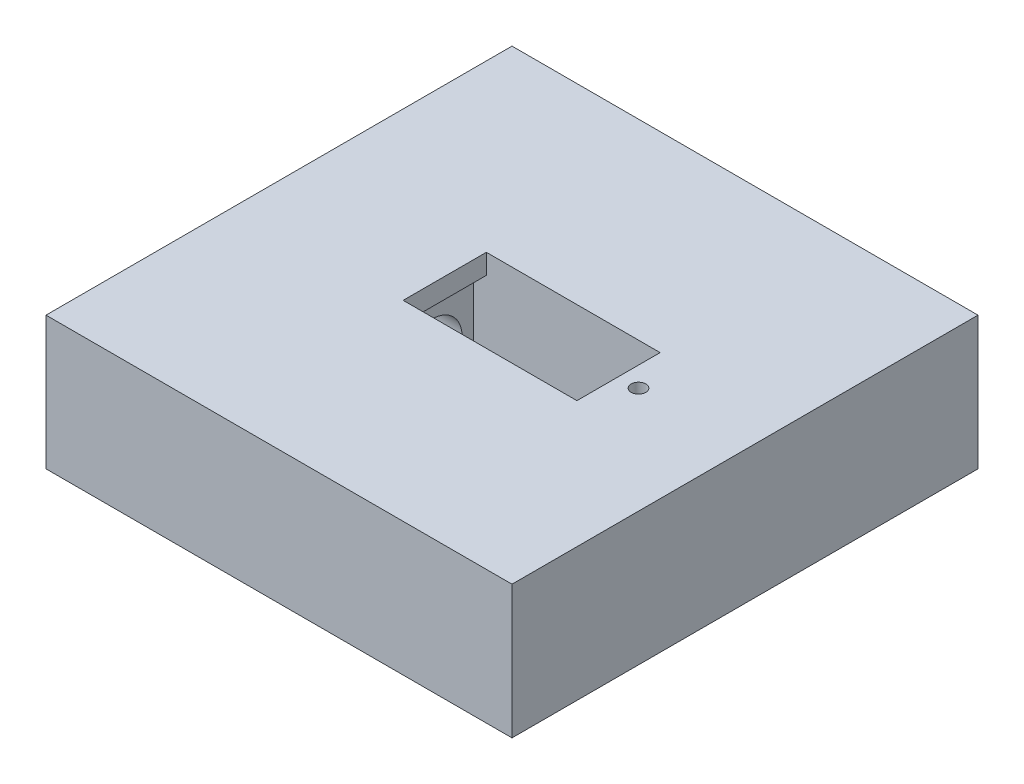
ISO-10303-21;
HEADER;
FILE_DESCRIPTION(('STEP AP214'),'2;1');
FILE_NAME('part.step','',(''),(''),'','','');
FILE_SCHEMA(('AUTOMOTIVE_DESIGN { 1 0 10303 214 1 1 1 1 }'));
ENDSEC;
DATA;
#1=APPLICATION_CONTEXT('core data for automotive mechanical design processes');
#2=APPLICATION_PROTOCOL_DEFINITION('international standard','automotive_design',2000,#1);
#3=PRODUCT_CONTEXT('',#1,'mechanical');
#4=PRODUCT('Part','Part','',(#3));
#5=PRODUCT_RELATED_PRODUCT_CATEGORY('part','',(#4));
#6=PRODUCT_DEFINITION_FORMATION('','',#4);
#7=PRODUCT_DEFINITION_CONTEXT('part definition',#1,'design');
#8=PRODUCT_DEFINITION('design','',#6,#7);
#9=PRODUCT_DEFINITION_SHAPE('','',#8);
#10=(LENGTH_UNIT() NAMED_UNIT(*) SI_UNIT(.MILLI.,.METRE.));
#11=(NAMED_UNIT(*) PLANE_ANGLE_UNIT() SI_UNIT($,.RADIAN.));
#12=(NAMED_UNIT(*) SI_UNIT($,.STERADIAN.) SOLID_ANGLE_UNIT());
#13=UNCERTAINTY_MEASURE_WITH_UNIT(LENGTH_MEASURE(1.E-05),#10,'distance_accuracy_value','');
#14=(GEOMETRIC_REPRESENTATION_CONTEXT(3) GLOBAL_UNCERTAINTY_ASSIGNED_CONTEXT((#13)) GLOBAL_UNIT_ASSIGNED_CONTEXT((#10,
#11,#12)) REPRESENTATION_CONTEXT('',''));
#15=CARTESIAN_POINT('',(0.,0.,0.));
#16=DIRECTION('',(0.,0.,1.));
#17=DIRECTION('',(1.,0.,0.));
#18=AXIS2_PLACEMENT_3D('',#15,#16,#17);
#19=CARTESIAN_POINT('',(-35.001,46.,22.1));
#20=DIRECTION('',(1.,0.,0.));
#21=DIRECTION('',(0.,0.,-1.));
#22=AXIS2_PLACEMENT_3D('',#19,#20,#21);
#23=CYLINDRICAL_SURFACE('',#22,4.50000000000001);
#24=CARTESIAN_POINT('',(-35.,46.,22.1));
#25=DIRECTION('',(1.,0.,0.));
#26=DIRECTION('',(0.,0.,-1.));
#27=AXIS2_PLACEMENT_3D('',#24,#25,#26);
#28=CIRCLE('',#27,4.50000000000001);
#29=CARTESIAN_POINT('',(-35.,46.,17.6));
#30=VERTEX_POINT('',#29);
#31=EDGE_CURVE('E243',#30,#30,#28,.F.);
#32=ORIENTED_EDGE('',*,*,#31,.T.);
#33=EDGE_LOOP('',(#32));
#34=FACE_BOUND('',#33,.T.);
#35=CARTESIAN_POINT('',(-12.,46.,22.1));
#36=DIRECTION('',(1.,0.,0.));
#37=DIRECTION('',(0.,0.,-1.));
#38=AXIS2_PLACEMENT_3D('',#35,#36,#37);
#39=CIRCLE('',#38,4.50000000000001);
#40=CARTESIAN_POINT('',(-12.,46.,17.6));
#41=VERTEX_POINT('',#40);
#42=EDGE_CURVE('E170',#41,#41,#39,.F.);
#43=ORIENTED_EDGE('',*,*,#42,.F.);
#44=EDGE_LOOP('',(#43));
#45=FACE_BOUND('',#44,.T.);
#46=ADVANCED_FACE('F38',(#34,#45),#23,.F.);
#47=CARTESIAN_POINT('',(-35.001,44.,0.));
#48=DIRECTION('',(1.,0.,0.));
#49=DIRECTION('',(0.,0.,-1.));
#50=AXIS2_PLACEMENT_3D('',#47,#48,#49);
#51=CYLINDRICAL_SURFACE('',#50,4.5);
#52=CARTESIAN_POINT('',(-35.,44.,0.));
#53=DIRECTION('',(1.,0.,0.));
#54=DIRECTION('',(0.,0.,-1.));
#55=AXIS2_PLACEMENT_3D('',#52,#53,#54);
#56=CIRCLE('',#55,4.5);
#57=CARTESIAN_POINT('',(-35.,44.,-4.5));
#58=VERTEX_POINT('',#57);
#59=EDGE_CURVE('E258',#58,#58,#56,.F.);
#60=ORIENTED_EDGE('',*,*,#59,.T.);
#61=EDGE_LOOP('',(#60));
#62=FACE_BOUND('',#61,.T.);
#63=CARTESIAN_POINT('',(-12.,44.,0.));
#64=DIRECTION('',(1.,0.,0.));
#65=DIRECTION('',(0.,0.,-1.));
#66=AXIS2_PLACEMENT_3D('',#63,#64,#65);
#67=CIRCLE('',#66,4.5);
#68=CARTESIAN_POINT('',(-12.,44.,-4.5));
#69=VERTEX_POINT('',#68);
#70=EDGE_CURVE('E225',#69,#69,#67,.F.);
#71=ORIENTED_EDGE('',*,*,#70,.F.);
#72=EDGE_LOOP('',(#71));
#73=FACE_BOUND('',#72,.T.);
#74=ADVANCED_FACE('F357',(#62,#73),#51,.F.);
#75=CARTESIAN_POINT('',(35.,64.,-35.));
#76=DIRECTION('',(-1.,0.,0.));
#77=DIRECTION('',(0.,0.,1.));
#78=AXIS2_PLACEMENT_3D('',#75,#76,#77);
#79=PLANE('',#78);
#80=DIRECTION('',(0.,-1.,0.));
#81=VECTOR('',#80,1.);
#82=CARTESIAN_POINT('',(35.,64.,-35.));
#83=LINE('',#82,#81);
#84=CARTESIAN_POINT('',(35.,55.,-35.));
#85=VERTEX_POINT('',#84);
#86=CARTESIAN_POINT('',(35.,35.0001693639848,-35.));
#87=VERTEX_POINT('',#86);
#88=EDGE_CURVE('E289',#85,#87,#83,.T.);
#89=ORIENTED_EDGE('',*,*,#88,.F.);
#90=DIRECTION('',(0.,0.,-1.));
#91=VECTOR('',#90,1.);
#92=CARTESIAN_POINT('',(35.,55.,35.));
#93=LINE('',#92,#91);
#94=CARTESIAN_POINT('',(35.,55.,35.));
#95=VERTEX_POINT('',#94);
#96=EDGE_CURVE('E180',#95,#85,#93,.T.);
#97=ORIENTED_EDGE('',*,*,#96,.F.);
#98=DIRECTION('',(0.,-1.,0.));
#99=VECTOR('',#98,1.);
#100=CARTESIAN_POINT('',(35.,64.,35.));
#101=LINE('',#100,#99);
#102=CARTESIAN_POINT('',(35.,35.0001693639848,35.));
#103=VERTEX_POINT('',#102);
#104=EDGE_CURVE('E278',#95,#103,#101,.T.);
#105=ORIENTED_EDGE('',*,*,#104,.T.);
#106=DIRECTION('',(0.,0.,1.));
#107=VECTOR('',#106,1.);
#108=CARTESIAN_POINT('',(35.,35.0001693639848,35.));
#109=LINE('',#108,#107);
#110=EDGE_CURVE('E192',#87,#103,#109,.T.);
#111=ORIENTED_EDGE('',*,*,#110,.F.);
#112=EDGE_LOOP('',(#89,#97,#105,#111));
#113=FACE_BOUND('',#112,.T.);
#114=ADVANCED_FACE('F40',(#113),#79,.F.);
#115=CARTESIAN_POINT('',(-35.,64.,-35.));
#116=DIRECTION('',(0.,0.,1.));
#117=DIRECTION('',(1.,0.,0.));
#118=AXIS2_PLACEMENT_3D('',#115,#116,#117);
#119=PLANE('',#118);
#120=DIRECTION('',(0.,-1.,0.));
#121=VECTOR('',#120,1.);
#122=CARTESIAN_POINT('',(-35.,64.,-35.));
#123=LINE('',#122,#121);
#124=CARTESIAN_POINT('',(-35.,55.,-35.));
#125=VERTEX_POINT('',#124);
#126=CARTESIAN_POINT('',(-35.,35.0001693639848,-35.));
#127=VERTEX_POINT('',#126);
#128=EDGE_CURVE('E286',#125,#127,#123,.T.);
#129=ORIENTED_EDGE('',*,*,#128,.F.);
#130=DIRECTION('',(1.,0.,0.));
#131=VECTOR('',#130,1.);
#132=CARTESIAN_POINT('',(-35.001,55.,-35.));
#133=LINE('',#132,#131);
#134=EDGE_CURVE('E184',#125,#85,#133,.T.);
#135=ORIENTED_EDGE('',*,*,#134,.T.);
#136=ORIENTED_EDGE('',*,*,#88,.T.);
#137=DIRECTION('',(1.,0.,0.));
#138=VECTOR('',#137,1.);
#139=CARTESIAN_POINT('',(-35.001,35.0001693639848,-35.));
#140=LINE('',#139,#138);
#141=EDGE_CURVE('E194',#127,#87,#140,.T.);
#142=ORIENTED_EDGE('',*,*,#141,.F.);
#143=EDGE_LOOP('',(#129,#135,#136,#142));
#144=FACE_BOUND('',#143,.T.);
#145=ADVANCED_FACE('F581',(#144),#119,.F.);
#146=CARTESIAN_POINT('',(-35.,64.,-35.));
#147=DIRECTION('',(1.,0.,0.));
#148=DIRECTION('',(0.,0.,-1.));
#149=AXIS2_PLACEMENT_3D('',#146,#147,#148);
#150=PLANE('',#149);
#151=ORIENTED_EDGE('',*,*,#31,.F.);
#152=EDGE_LOOP('',(#151));
#153=FACE_BOUND('',#152,.T.);
#154=ORIENTED_EDGE('',*,*,#59,.F.);
#155=EDGE_LOOP('',(#154));
#156=FACE_BOUND('',#155,.T.);
#157=DIRECTION('',(0.,-1.,0.));
#158=VECTOR('',#157,1.);
#159=CARTESIAN_POINT('',(-35.,64.,35.));
#160=LINE('',#159,#158);
#161=CARTESIAN_POINT('',(-35.,55.,35.));
#162=VERTEX_POINT('',#161);
#163=CARTESIAN_POINT('',(-35.,35.0001693639848,35.));
#164=VERTEX_POINT('',#163);
#165=EDGE_CURVE('E283',#162,#164,#160,.T.);
#166=ORIENTED_EDGE('',*,*,#165,.F.);
#167=DIRECTION('',(0.,0.,1.));
#168=VECTOR('',#167,1.);
#169=CARTESIAN_POINT('',(-35.,55.,35.));
#170=LINE('',#169,#168);
#171=EDGE_CURVE('E187',#125,#162,#170,.T.);
#172=ORIENTED_EDGE('',*,*,#171,.F.);
#173=ORIENTED_EDGE('',*,*,#128,.T.);
#174=DIRECTION('',(0.,0.,-1.));
#175=VECTOR('',#174,1.);
#176=CARTESIAN_POINT('',(-35.,35.0001693639848,35.));
#177=LINE('',#176,#175);
#178=EDGE_CURVE('E173',#164,#127,#177,.T.);
#179=ORIENTED_EDGE('',*,*,#178,.F.);
#180=EDGE_LOOP('',(#166,#172,#173,#179));
#181=FACE_BOUND('',#180,.T.);
#182=ADVANCED_FACE('F573',(#153,#156,#181),#150,.F.);
#183=CARTESIAN_POINT('',(-35.,64.,35.));
#184=DIRECTION('',(0.,0.,-1.));
#185=DIRECTION('',(-1.,0.,0.));
#186=AXIS2_PLACEMENT_3D('',#183,#184,#185);
#187=PLANE('',#186);
#188=ORIENTED_EDGE('',*,*,#104,.F.);
#189=DIRECTION('',(1.,0.,0.));
#190=VECTOR('',#189,1.);
#191=CARTESIAN_POINT('',(-35.001,55.,35.));
#192=LINE('',#191,#190);
#193=EDGE_CURVE('E182',#162,#95,#192,.T.);
#194=ORIENTED_EDGE('',*,*,#193,.F.);
#195=ORIENTED_EDGE('',*,*,#165,.T.);
#196=DIRECTION('',(1.,0.,0.));
#197=VECTOR('',#196,1.);
#198=CARTESIAN_POINT('',(-35.001,35.0001693639848,35.));
#199=LINE('',#198,#197);
#200=EDGE_CURVE('E195',#164,#103,#199,.T.);
#201=ORIENTED_EDGE('',*,*,#200,.T.);
#202=EDGE_LOOP('',(#188,#194,#195,#201));
#203=FACE_BOUND('',#202,.T.);
#204=ADVANCED_FACE('F566',(#203),#187,.F.);
#205=CARTESIAN_POINT('',(16.,39.,6.));
#206=DIRECTION('',(1.,0.,0.));
#207=DIRECTION('',(0.,0.,-1.));
#208=AXIS2_PLACEMENT_3D('',#205,#206,#207);
#209=PLANE('',#208);
#210=DIRECTION('',(0.,1.,0.));
#211=VECTOR('',#210,1.);
#212=CARTESIAN_POINT('',(16.,39.,6.25));
#213=LINE('',#212,#211);
#214=CARTESIAN_POINT('',(16.,39.,6.25));
#215=VERTEX_POINT('',#214);
#216=CARTESIAN_POINT('',(16.,55.,6.25));
#217=VERTEX_POINT('',#216);
#218=EDGE_CURVE('E275',#215,#217,#213,.T.);
#219=ORIENTED_EDGE('',*,*,#218,.T.);
#220=DIRECTION('',(0.,0.,-1.));
#221=VECTOR('',#220,1.);
#222=CARTESIAN_POINT('',(16.,55.,6.));
#223=LINE('',#222,#221);
#224=CARTESIAN_POINT('',(16.,55.,-6.25));
#225=VERTEX_POINT('',#224);
#226=EDGE_CURVE('E234',#217,#225,#223,.T.);
#227=ORIENTED_EDGE('',*,*,#226,.T.);
#228=DIRECTION('',(0.,1.,0.));
#229=VECTOR('',#228,1.);
#230=CARTESIAN_POINT('',(16.,39.,-6.25));
#231=LINE('',#230,#229);
#232=CARTESIAN_POINT('',(16.,39.,-6.25));
#233=VERTEX_POINT('',#232);
#234=EDGE_CURVE('E274',#233,#225,#231,.T.);
#235=ORIENTED_EDGE('',*,*,#234,.F.);
#236=DIRECTION('',(0.,0.,-1.));
#237=VECTOR('',#236,1.);
#238=CARTESIAN_POINT('',(16.,39.,-6.25));
#239=LINE('',#238,#237);
#240=EDGE_CURVE('E266',#215,#233,#239,.T.);
#241=ORIENTED_EDGE('',*,*,#240,.F.);
#242=EDGE_LOOP('',(#219,#227,#235,#241));
#243=FACE_BOUND('',#242,.T.);
#244=ADVANCED_FACE('F321',(#243),#209,.F.);
#245=CARTESIAN_POINT('',(16.,39.,6.25));
#246=DIRECTION('',(0.,0.,1.));
#247=DIRECTION('',(1.,0.,0.));
#248=AXIS2_PLACEMENT_3D('',#245,#246,#247);
#249=PLANE('',#248);
#250=DIRECTION('',(0.,-1.,0.));
#251=VECTOR('',#250,1.);
#252=CARTESIAN_POINT('',(-10.1,55.001,6.25));
#253=LINE('',#252,#251);
#254=CARTESIAN_POINT('',(-10.1,55.,6.25));
#255=VERTEX_POINT('',#254);
#256=CARTESIAN_POINT('',(-10.1,51.9986853970522,6.25));
#257=VERTEX_POINT('',#256);
#258=EDGE_CURVE('E303',#255,#257,#253,.T.);
#259=ORIENTED_EDGE('',*,*,#258,.F.);
#260=DIRECTION('',(1.,0.,0.));
#261=VECTOR('',#260,1.);
#262=CARTESIAN_POINT('',(16.,55.,6.25));
#263=LINE('',#262,#261);
#264=EDGE_CURVE('E230',#255,#217,#263,.T.);
#265=ORIENTED_EDGE('',*,*,#264,.T.);
#266=ORIENTED_EDGE('',*,*,#218,.F.);
#267=DIRECTION('',(1.,0.,0.));
#268=VECTOR('',#267,1.);
#269=CARTESIAN_POINT('',(16.,39.,6.25));
#270=LINE('',#269,#268);
#271=CARTESIAN_POINT('',(-12.,39.,6.25));
#272=VERTEX_POINT('',#271);
#273=EDGE_CURVE('E271',#272,#215,#270,.T.);
#274=ORIENTED_EDGE('',*,*,#273,.F.);
#275=DIRECTION('',(0.,-1.,0.));
#276=VECTOR('',#275,1.);
#277=CARTESIAN_POINT('',(-12.,51.9986853970522,6.25));
#278=LINE('',#277,#276);
#279=CARTESIAN_POINT('',(-12.,51.9986853970522,6.25));
#280=VERTEX_POINT('',#279);
#281=EDGE_CURVE('E215',#280,#272,#278,.T.);
#282=ORIENTED_EDGE('',*,*,#281,.F.);
#283=DIRECTION('',(1.,0.,0.));
#284=VECTOR('',#283,1.);
#285=CARTESIAN_POINT('',(-12.,51.9986853970522,6.25));
#286=LINE('',#285,#284);
#287=EDGE_CURVE('E222',#280,#257,#286,.T.);
#288=ORIENTED_EDGE('',*,*,#287,.T.);
#289=EDGE_LOOP('',(#259,#265,#266,#274,#282,#288));
#290=FACE_BOUND('',#289,.T.);
#291=ADVANCED_FACE('F309',(#290),#249,.F.);
#292=CARTESIAN_POINT('',(-7.,39.,-6.25));
#293=DIRECTION('',(0.,0.,-1.));
#294=DIRECTION('',(-1.,0.,0.));
#295=AXIS2_PLACEMENT_3D('',#292,#293,#294);
#296=PLANE('',#295);
#297=DIRECTION('',(-1.,0.,0.));
#298=VECTOR('',#297,1.);
#299=CARTESIAN_POINT('',(-7.,55.,-6.25));
#300=LINE('',#299,#298);
#301=CARTESIAN_POINT('',(-10.1,55.,-6.25));
#302=VERTEX_POINT('',#301);
#303=EDGE_CURVE('E228',#225,#302,#300,.T.);
#304=ORIENTED_EDGE('',*,*,#303,.T.);
#305=DIRECTION('',(0.,-1.,0.));
#306=VECTOR('',#305,1.);
#307=CARTESIAN_POINT('',(-10.1,55.001,-6.25));
#308=LINE('',#307,#306);
#309=CARTESIAN_POINT('',(-10.1,51.9986853970522,-6.25));
#310=VERTEX_POINT('',#309);
#311=EDGE_CURVE('E61',#302,#310,#308,.T.);
#312=ORIENTED_EDGE('',*,*,#311,.T.);
#313=DIRECTION('',(1.,0.,0.));
#314=VECTOR('',#313,1.);
#315=CARTESIAN_POINT('',(-12.,51.9986853970522,-6.25));
#316=LINE('',#315,#314);
#317=CARTESIAN_POINT('',(-12.,51.9986853970522,-6.25));
#318=VERTEX_POINT('',#317);
#319=EDGE_CURVE('E221',#318,#310,#316,.T.);
#320=ORIENTED_EDGE('',*,*,#319,.F.);
#321=DIRECTION('',(0.,1.,0.));
#322=VECTOR('',#321,1.);
#323=CARTESIAN_POINT('',(-12.,39.,-6.25));
#324=LINE('',#323,#322);
#325=CARTESIAN_POINT('',(-12.,39.,-6.25));
#326=VERTEX_POINT('',#325);
#327=EDGE_CURVE('E190',#326,#318,#324,.T.);
#328=ORIENTED_EDGE('',*,*,#327,.F.);
#329=DIRECTION('',(-1.,0.,0.));
#330=VECTOR('',#329,1.);
#331=CARTESIAN_POINT('',(-7.,39.,-6.25));
#332=LINE('',#331,#330);
#333=EDGE_CURVE('E269',#233,#326,#332,.T.);
#334=ORIENTED_EDGE('',*,*,#333,.F.);
#335=ORIENTED_EDGE('',*,*,#234,.T.);
#336=EDGE_LOOP('',(#304,#312,#320,#328,#334,#335));
#337=FACE_BOUND('',#336,.T.);
#338=ADVANCED_FACE('F317',(#337),#296,.F.);
#339=CARTESIAN_POINT('',(0.,39.,0.));
#340=DIRECTION('',(0.,-1.,0.));
#341=DIRECTION('',(0.,0.,-1.));
#342=AXIS2_PLACEMENT_3D('',#339,#340,#341);
#343=PLANE('',#342);
#344=ORIENTED_EDGE('',*,*,#240,.T.);
#345=ORIENTED_EDGE('',*,*,#333,.T.);
#346=DIRECTION('',(0.,0.,-1.));
#347=VECTOR('',#346,1.);
#348=CARTESIAN_POINT('',(-12.,39.,6.25));
#349=LINE('',#348,#347);
#350=EDGE_CURVE('E218',#272,#326,#349,.T.);
#351=ORIENTED_EDGE('',*,*,#350,.F.);
#352=ORIENTED_EDGE('',*,*,#273,.T.);
#353=EDGE_LOOP('',(#344,#345,#351,#352));
#354=FACE_BOUND('',#353,.T.);
#355=ADVANCED_FACE('F319',(#354),#343,.F.);
#356=CARTESIAN_POINT('',(-7.,51.,28.2));
#357=DIRECTION('',(0.,0.,1.));
#358=DIRECTION('',(1.,0.,0.));
#359=AXIS2_PLACEMENT_3D('',#356,#357,#358);
#360=PLANE('',#359);
#361=DIRECTION('',(1.,0.,0.));
#362=VECTOR('',#361,1.);
#363=CARTESIAN_POINT('',(-35.001,35.0001693639848,28.2));
#364=LINE('',#363,#362);
#365=CARTESIAN_POINT('',(-10.1,35.0001693639848,28.2));
#366=VERTEX_POINT('',#365);
#367=CARTESIAN_POINT('',(16.,35.0001693639848,28.2));
#368=VERTEX_POINT('',#367);
#369=EDGE_CURVE('E183',#366,#368,#364,.T.);
#370=ORIENTED_EDGE('',*,*,#369,.F.);
#371=DIRECTION('',(0.,1.,0.));
#372=VECTOR('',#371,1.);
#373=CARTESIAN_POINT('',(-10.1,34.9991693639848,28.2));
#374=LINE('',#373,#372);
#375=CARTESIAN_POINT('',(-10.1,38.0001693639849,28.2));
#376=VERTEX_POINT('',#375);
#377=EDGE_CURVE('E53',#366,#376,#374,.T.);
#378=ORIENTED_EDGE('',*,*,#377,.T.);
#379=DIRECTION('',(1.,0.,0.));
#380=VECTOR('',#379,1.);
#381=CARTESIAN_POINT('',(-12.,38.0001693639849,28.2));
#382=LINE('',#381,#380);
#383=CARTESIAN_POINT('',(-12.,38.0001693639849,28.2));
#384=VERTEX_POINT('',#383);
#385=EDGE_CURVE('E156',#384,#376,#382,.T.);
#386=ORIENTED_EDGE('',*,*,#385,.F.);
#387=DIRECTION('',(0.,-1.,0.));
#388=VECTOR('',#387,1.);
#389=CARTESIAN_POINT('',(-12.,51.,28.2));
#390=LINE('',#389,#388);
#391=CARTESIAN_POINT('',(-12.,51.,28.2));
#392=VERTEX_POINT('',#391);
#393=EDGE_CURVE('E332',#392,#384,#390,.T.);
#394=ORIENTED_EDGE('',*,*,#393,.F.);
#395=DIRECTION('',(-1.,0.,0.));
#396=VECTOR('',#395,1.);
#397=CARTESIAN_POINT('',(-7.,51.,28.2));
#398=LINE('',#397,#396);
#399=CARTESIAN_POINT('',(16.,51.,28.2));
#400=VERTEX_POINT('',#399);
#401=EDGE_CURVE('E246',#400,#392,#398,.T.);
#402=ORIENTED_EDGE('',*,*,#401,.F.);
#403=DIRECTION('',(0.,-1.,0.));
#404=VECTOR('',#403,1.);
#405=CARTESIAN_POINT('',(16.,51.,28.2));
#406=LINE('',#405,#404);
#407=EDGE_CURVE('E255',#400,#368,#406,.T.);
#408=ORIENTED_EDGE('',*,*,#407,.T.);
#409=EDGE_LOOP('',(#370,#378,#386,#394,#402,#408));
#410=FACE_BOUND('',#409,.T.);
#411=ADVANCED_FACE('F343',(#410),#360,.F.);
#412=CARTESIAN_POINT('',(16.,51.,16.));
#413=DIRECTION('',(1.,0.,0.));
#414=DIRECTION('',(0.,0.,-1.));
#415=AXIS2_PLACEMENT_3D('',#412,#413,#414);
#416=PLANE('',#415);
#417=DIRECTION('',(0.,-1.,0.));
#418=VECTOR('',#417,1.);
#419=CARTESIAN_POINT('',(16.,51.,16.));
#420=LINE('',#419,#418);
#421=CARTESIAN_POINT('',(16.,51.,16.));
#422=VERTEX_POINT('',#421);
#423=CARTESIAN_POINT('',(16.,35.0001693639848,16.));
#424=VERTEX_POINT('',#423);
#425=EDGE_CURVE('E254',#422,#424,#420,.T.);
#426=ORIENTED_EDGE('',*,*,#425,.T.);
#427=DIRECTION('',(0.,0.,-1.));
#428=VECTOR('',#427,1.);
#429=CARTESIAN_POINT('',(16.,35.0001693639848,35.));
#430=LINE('',#429,#428);
#431=EDGE_CURVE('E207',#368,#424,#430,.T.);
#432=ORIENTED_EDGE('',*,*,#431,.F.);
#433=ORIENTED_EDGE('',*,*,#407,.F.);
#434=DIRECTION('',(0.,0.,1.));
#435=VECTOR('',#434,1.);
#436=CARTESIAN_POINT('',(16.,51.,16.));
#437=LINE('',#436,#435);
#438=EDGE_CURVE('E251',#422,#400,#437,.T.);
#439=ORIENTED_EDGE('',*,*,#438,.F.);
#440=EDGE_LOOP('',(#426,#432,#433,#439));
#441=FACE_BOUND('',#440,.T.);
#442=ADVANCED_FACE('F345',(#441),#416,.F.);
#443=CARTESIAN_POINT('',(-7.,51.,16.));
#444=DIRECTION('',(0.,0.,-1.));
#445=DIRECTION('',(-1.,0.,0.));
#446=AXIS2_PLACEMENT_3D('',#443,#444,#445);
#447=PLANE('',#446);
#448=DIRECTION('',(0.,1.,0.));
#449=VECTOR('',#448,1.);
#450=CARTESIAN_POINT('',(-10.1,34.9991693639848,16.));
#451=LINE('',#450,#449);
#452=CARTESIAN_POINT('',(-10.1,35.0001693639848,16.));
#453=VERTEX_POINT('',#452);
#454=CARTESIAN_POINT('',(-10.1,38.0001693639849,16.));
#455=VERTEX_POINT('',#454);
#456=EDGE_CURVE('E160',#453,#455,#451,.T.);
#457=ORIENTED_EDGE('',*,*,#456,.F.);
#458=DIRECTION('',(-1.,0.,0.));
#459=VECTOR('',#458,1.);
#460=CARTESIAN_POINT('',(-35.001,35.0001693639848,16.));
#461=LINE('',#460,#459);
#462=EDGE_CURVE('E205',#424,#453,#461,.T.);
#463=ORIENTED_EDGE('',*,*,#462,.F.);
#464=ORIENTED_EDGE('',*,*,#425,.F.);
#465=DIRECTION('',(1.,0.,0.));
#466=VECTOR('',#465,1.);
#467=CARTESIAN_POINT('',(-7.,51.,16.));
#468=LINE('',#467,#466);
#469=CARTESIAN_POINT('',(-12.,51.,16.));
#470=VERTEX_POINT('',#469);
#471=EDGE_CURVE('E248',#470,#422,#468,.T.);
#472=ORIENTED_EDGE('',*,*,#471,.F.);
#473=DIRECTION('',(0.,1.,0.));
#474=VECTOR('',#473,1.);
#475=CARTESIAN_POINT('',(-12.,51.,16.));
#476=LINE('',#475,#474);
#477=CARTESIAN_POINT('',(-12.,38.0001693639849,16.));
#478=VERTEX_POINT('',#477);
#479=EDGE_CURVE('E169',#478,#470,#476,.T.);
#480=ORIENTED_EDGE('',*,*,#479,.F.);
#481=DIRECTION('',(1.,0.,0.));
#482=VECTOR('',#481,1.);
#483=CARTESIAN_POINT('',(-12.,38.0001693639849,16.));
#484=LINE('',#483,#482);
#485=EDGE_CURVE('E154',#478,#455,#484,.T.);
#486=ORIENTED_EDGE('',*,*,#485,.T.);
#487=EDGE_LOOP('',(#457,#463,#464,#472,#480,#486));
#488=FACE_BOUND('',#487,.T.);
#489=ADVANCED_FACE('F167',(#488),#447,.F.);
#490=CARTESIAN_POINT('',(0.,51.,0.));
#491=DIRECTION('',(0.,-1.,0.));
#492=DIRECTION('',(0.,0.,-1.));
#493=AXIS2_PLACEMENT_3D('',#490,#491,#492);
#494=PLANE('',#493);
#495=ORIENTED_EDGE('',*,*,#401,.T.);
#496=DIRECTION('',(0.,0.,1.));
#497=VECTOR('',#496,1.);
#498=CARTESIAN_POINT('',(-12.,51.,16.));
#499=LINE('',#498,#497);
#500=EDGE_CURVE('E330',#470,#392,#499,.T.);
#501=ORIENTED_EDGE('',*,*,#500,.F.);
#502=ORIENTED_EDGE('',*,*,#471,.T.);
#503=ORIENTED_EDGE('',*,*,#438,.T.);
#504=EDGE_LOOP('',(#495,#501,#502,#503));
#505=FACE_BOUND('',#504,.T.);
#506=ADVANCED_FACE('F340',(#505),#494,.T.);
#507=CARTESIAN_POINT('',(0.,55.,0.));
#508=DIRECTION('',(0.,-1.,0.));
#509=DIRECTION('',(0.,0.,-1.));
#510=AXIS2_PLACEMENT_3D('',#507,#508,#509);
#511=PLANE('',#510);
#512=ORIENTED_EDGE('',*,*,#264,.F.);
#513=DIRECTION('',(0.,0.,-1.));
#514=VECTOR('',#513,1.);
#515=CARTESIAN_POINT('',(-10.1,55.,0.));
#516=LINE('',#515,#514);
#517=EDGE_CURVE('E306',#255,#302,#516,.T.);
#518=ORIENTED_EDGE('',*,*,#517,.T.);
#519=ORIENTED_EDGE('',*,*,#303,.F.);
#520=ORIENTED_EDGE('',*,*,#226,.F.);
#521=EDGE_LOOP('',(#512,#518,#519,#520));
#522=FACE_BOUND('',#521,.T.);
#523=CARTESIAN_POINT('',(19.,55.,0.));
#524=DIRECTION('',(0.,-1.,0.));
#525=DIRECTION('',(0.,0.,-1.));
#526=AXIS2_PLACEMENT_3D('',#523,#524,#525);
#527=CIRCLE('',#526,1.1);
#528=CARTESIAN_POINT('',(19.,55.,-1.1));
#529=VERTEX_POINT('',#528);
#530=EDGE_CURVE('E231',#529,#529,#527,.F.);
#531=ORIENTED_EDGE('',*,*,#530,.F.);
#532=EDGE_LOOP('',(#531));
#533=FACE_BOUND('',#532,.T.);
#534=ORIENTED_EDGE('',*,*,#171,.T.);
#535=ORIENTED_EDGE('',*,*,#193,.T.);
#536=ORIENTED_EDGE('',*,*,#96,.T.);
#537=ORIENTED_EDGE('',*,*,#134,.F.);
#538=EDGE_LOOP('',(#534,#535,#536,#537));
#539=FACE_BOUND('',#538,.T.);
#540=ADVANCED_FACE('F323',(#522,#533,#539),#511,.F.);
#541=CARTESIAN_POINT('',(19.,50.,0.));
#542=DIRECTION('',(0.,1.,0.));
#543=DIRECTION('',(0.,0.,1.));
#544=AXIS2_PLACEMENT_3D('',#541,#542,#543);
#545=PLANE('',#544);
#546=CARTESIAN_POINT('',(19.,50.,0.));
#547=DIRECTION('',(0.,1.,0.));
#548=DIRECTION('',(0.,0.,1.));
#549=AXIS2_PLACEMENT_3D('',#546,#547,#548);
#550=CIRCLE('',#549,1.1);
#551=CARTESIAN_POINT('',(19.,50.,1.1));
#552=VERTEX_POINT('',#551);
#553=EDGE_CURVE('E263',#552,#552,#550,.T.);
#554=ORIENTED_EDGE('',*,*,#553,.T.);
#555=EDGE_LOOP('',(#554));
#556=FACE_BOUND('',#555,.T.);
#557=ADVANCED_FACE('F387',(#556),#545,.T.);
#558=CARTESIAN_POINT('',(19.,50.,0.));
#559=DIRECTION('',(0.,1.,0.));
#560=DIRECTION('',(0.,0.,1.));
#561=AXIS2_PLACEMENT_3D('',#558,#559,#560);
#562=CYLINDRICAL_SURFACE('',#561,1.1);
#563=ORIENTED_EDGE('',*,*,#530,.T.);
#564=EDGE_LOOP('',(#563));
#565=FACE_BOUND('',#564,.T.);
#566=ORIENTED_EDGE('',*,*,#553,.F.);
#567=EDGE_LOOP('',(#566));
#568=FACE_BOUND('',#567,.T.);
#569=ADVANCED_FACE('F396',(#565,#568),#562,.F.);
#570=CARTESIAN_POINT('',(-12.,0.,0.));
#571=DIRECTION('',(1.,0.,0.));
#572=DIRECTION('',(0.,0.,-1.));
#573=AXIS2_PLACEMENT_3D('',#570,#571,#572);
#574=PLANE('',#573);
#575=ORIENTED_EDGE('',*,*,#327,.T.);
#576=DIRECTION('',(0.,0.,1.));
#577=VECTOR('',#576,1.);
#578=CARTESIAN_POINT('',(-12.,51.9986853970522,-6.25));
#579=LINE('',#578,#577);
#580=EDGE_CURVE('E212',#318,#280,#579,.T.);
#581=ORIENTED_EDGE('',*,*,#580,.T.);
#582=ORIENTED_EDGE('',*,*,#281,.T.);
#583=ORIENTED_EDGE('',*,*,#350,.T.);
#584=EDGE_LOOP('',(#575,#581,#582,#583));
#585=FACE_BOUND('',#584,.T.);
#586=ORIENTED_EDGE('',*,*,#70,.T.);
#587=EDGE_LOOP('',(#586));
#588=FACE_BOUND('',#587,.T.);
#589=ADVANCED_FACE('F313',(#585,#588),#574,.T.);
#590=CARTESIAN_POINT('',(-12.,51.9986853970522,-6.25));
#591=DIRECTION('',(0.,1.,0.));
#592=DIRECTION('',(0.,0.,1.));
#593=AXIS2_PLACEMENT_3D('',#590,#591,#592);
#594=PLANE('',#593);
#595=ORIENTED_EDGE('',*,*,#319,.T.);
#596=DIRECTION('',(0.,0.,1.));
#597=VECTOR('',#596,1.);
#598=CARTESIAN_POINT('',(-10.1,51.9986853970522,-6.25));
#599=LINE('',#598,#597);
#600=EDGE_CURVE('E46',#310,#257,#599,.T.);
#601=ORIENTED_EDGE('',*,*,#600,.T.);
#602=ORIENTED_EDGE('',*,*,#287,.F.);
#603=ORIENTED_EDGE('',*,*,#580,.F.);
#604=EDGE_LOOP('',(#595,#601,#602,#603));
#605=FACE_BOUND('',#604,.T.);
#606=ADVANCED_FACE('F297',(#605),#594,.F.);
#607=CARTESIAN_POINT('',(-35.001,35.0001693639848,35.));
#608=DIRECTION('',(0.,1.,0.));
#609=DIRECTION('',(0.,0.,1.));
#610=AXIS2_PLACEMENT_3D('',#607,#608,#609);
#611=PLANE('',#610);
#612=ORIENTED_EDGE('',*,*,#462,.T.);
#613=DIRECTION('',(0.,0.,1.));
#614=VECTOR('',#613,1.);
#615=CARTESIAN_POINT('',(-10.1,35.0001693639848,35.));
#616=LINE('',#615,#614);
#617=EDGE_CURVE('E163',#453,#366,#616,.T.);
#618=ORIENTED_EDGE('',*,*,#617,.T.);
#619=ORIENTED_EDGE('',*,*,#369,.T.);
#620=ORIENTED_EDGE('',*,*,#431,.T.);
#621=EDGE_LOOP('',(#612,#618,#619,#620));
#622=FACE_BOUND('',#621,.T.);
#623=ORIENTED_EDGE('',*,*,#178,.T.);
#624=ORIENTED_EDGE('',*,*,#141,.T.);
#625=ORIENTED_EDGE('',*,*,#110,.T.);
#626=ORIENTED_EDGE('',*,*,#200,.F.);
#627=EDGE_LOOP('',(#623,#624,#625,#626));
#628=FACE_BOUND('',#627,.T.);
#629=CARTESIAN_POINT('',(19.,35.0001693639848,22.1));
#630=DIRECTION('',(0.,1.,0.));
#631=DIRECTION('',(0.,0.,1.));
#632=AXIS2_PLACEMENT_3D('',#629,#630,#631);
#633=CIRCLE('',#632,1.1);
#634=CARTESIAN_POINT('',(19.,35.0001693639848,23.2));
#635=VERTEX_POINT('',#634);
#636=EDGE_CURVE('E202',#635,#635,#633,.T.);
#637=ORIENTED_EDGE('',*,*,#636,.T.);
#638=EDGE_LOOP('',(#637));
#639=FACE_BOUND('',#638,.T.);
#640=CARTESIAN_POINT('',(0.,35.0001693639848,-22.1));
#641=DIRECTION('',(0.,1.,0.));
#642=DIRECTION('',(0.,0.,1.));
#643=AXIS2_PLACEMENT_3D('',#640,#641,#642);
#644=CIRCLE('',#643,3.7);
#645=CARTESIAN_POINT('',(0.,35.0001693639848,-18.4));
#646=VERTEX_POINT('',#645);
#647=EDGE_CURVE('E198',#646,#646,#644,.T.);
#648=ORIENTED_EDGE('',*,*,#647,.T.);
#649=EDGE_LOOP('',(#648));
#650=FACE_BOUND('',#649,.T.);
#651=ADVANCED_FACE('F421',(#622,#628,#639,#650),#611,.F.);
#652=CARTESIAN_POINT('',(19.,40.,22.1));
#653=DIRECTION('',(0.,-1.,0.));
#654=DIRECTION('',(0.,0.,-1.));
#655=AXIS2_PLACEMENT_3D('',#652,#653,#654);
#656=PLANE('',#655);
#657=CARTESIAN_POINT('',(19.,40.,22.1));
#658=DIRECTION('',(0.,-1.,0.));
#659=DIRECTION('',(0.,0.,-1.));
#660=AXIS2_PLACEMENT_3D('',#657,#658,#659);
#661=CIRCLE('',#660,1.1);
#662=CARTESIAN_POINT('',(19.,40.,21.));
#663=VERTEX_POINT('',#662);
#664=EDGE_CURVE('E240',#663,#663,#661,.T.);
#665=ORIENTED_EDGE('',*,*,#664,.T.);
#666=EDGE_LOOP('',(#665));
#667=FACE_BOUND('',#666,.T.);
#668=ADVANCED_FACE('F428',(#667),#656,.T.);
#669=CARTESIAN_POINT('',(19.,40.,22.1));
#670=DIRECTION('',(0.,-1.,0.));
#671=DIRECTION('',(0.,0.,-1.));
#672=AXIS2_PLACEMENT_3D('',#669,#670,#671);
#673=CYLINDRICAL_SURFACE('',#672,1.1);
#674=ORIENTED_EDGE('',*,*,#636,.F.);
#675=EDGE_LOOP('',(#674));
#676=FACE_BOUND('',#675,.T.);
#677=ORIENTED_EDGE('',*,*,#664,.F.);
#678=EDGE_LOOP('',(#677));
#679=FACE_BOUND('',#678,.T.);
#680=ADVANCED_FACE('F367',(#676,#679),#673,.F.);
#681=CARTESIAN_POINT('',(0.,40.,-22.1));
#682=DIRECTION('',(0.,-1.,0.));
#683=DIRECTION('',(0.,0.,-1.));
#684=AXIS2_PLACEMENT_3D('',#681,#682,#683);
#685=PLANE('',#684);
#686=CARTESIAN_POINT('',(0.,40.,-22.1));
#687=DIRECTION('',(0.,-1.,0.));
#688=DIRECTION('',(0.,0.,-1.));
#689=AXIS2_PLACEMENT_3D('',#686,#687,#688);
#690=CIRCLE('',#689,3.7);
#691=CARTESIAN_POINT('',(0.,40.,-25.8));
#692=VERTEX_POINT('',#691);
#693=EDGE_CURVE('E237',#692,#692,#690,.T.);
#694=ORIENTED_EDGE('',*,*,#693,.T.);
#695=EDGE_LOOP('',(#694));
#696=FACE_BOUND('',#695,.T.);
#697=ADVANCED_FACE('F443',(#696),#685,.T.);
#698=CARTESIAN_POINT('',(0.,40.,-22.1));
#699=DIRECTION('',(0.,-1.,0.));
#700=DIRECTION('',(0.,0.,-1.));
#701=AXIS2_PLACEMENT_3D('',#698,#699,#700);
#702=CYLINDRICAL_SURFACE('',#701,3.7);
#703=ORIENTED_EDGE('',*,*,#647,.F.);
#704=EDGE_LOOP('',(#703));
#705=FACE_BOUND('',#704,.T.);
#706=ORIENTED_EDGE('',*,*,#693,.F.);
#707=EDGE_LOOP('',(#706));
#708=FACE_BOUND('',#707,.T.);
#709=ADVANCED_FACE('F450',(#705,#708),#702,.F.);
#710=CARTESIAN_POINT('',(-12.,0.,0.));
#711=DIRECTION('',(1.,0.,0.));
#712=DIRECTION('',(0.,0.,-1.));
#713=AXIS2_PLACEMENT_3D('',#710,#711,#712);
#714=PLANE('',#713);
#715=ORIENTED_EDGE('',*,*,#479,.T.);
#716=ORIENTED_EDGE('',*,*,#500,.T.);
#717=ORIENTED_EDGE('',*,*,#393,.T.);
#718=DIRECTION('',(0.,0.,-1.));
#719=VECTOR('',#718,1.);
#720=CARTESIAN_POINT('',(-12.,38.0001693639849,22.1));
#721=LINE('',#720,#719);
#722=EDGE_CURVE('E175',#384,#478,#721,.T.);
#723=ORIENTED_EDGE('',*,*,#722,.T.);
#724=EDGE_LOOP('',(#715,#716,#717,#723));
#725=FACE_BOUND('',#724,.T.);
#726=ORIENTED_EDGE('',*,*,#42,.T.);
#727=EDGE_LOOP('',(#726));
#728=FACE_BOUND('',#727,.T.);
#729=ADVANCED_FACE('F336',(#725,#728),#714,.T.);
#730=CARTESIAN_POINT('',(-12.,38.0001693639849,22.1));
#731=DIRECTION('',(0.,-1.,0.));
#732=DIRECTION('',(0.,0.,-1.));
#733=AXIS2_PLACEMENT_3D('',#730,#731,#732);
#734=PLANE('',#733);
#735=ORIENTED_EDGE('',*,*,#385,.T.);
#736=DIRECTION('',(0.,0.,-1.));
#737=VECTOR('',#736,1.);
#738=CARTESIAN_POINT('',(-10.1,38.0001693639849,22.1));
#739=LINE('',#738,#737);
#740=EDGE_CURVE('E11',#376,#455,#739,.T.);
#741=ORIENTED_EDGE('',*,*,#740,.T.);
#742=ORIENTED_EDGE('',*,*,#485,.F.);
#743=ORIENTED_EDGE('',*,*,#722,.F.);
#744=EDGE_LOOP('',(#735,#741,#742,#743));
#745=FACE_BOUND('',#744,.T.);
#746=ADVANCED_FACE('F151',(#745),#734,.F.);
#747=CARTESIAN_POINT('',(-10.1,55.001,6.25));
#748=DIRECTION('',(-1.,0.,0.));
#749=DIRECTION('',(0.,0.,1.));
#750=AXIS2_PLACEMENT_3D('',#747,#748,#749);
#751=PLANE('',#750);
#752=ORIENTED_EDGE('',*,*,#517,.F.);
#753=ORIENTED_EDGE('',*,*,#258,.T.);
#754=ORIENTED_EDGE('',*,*,#600,.F.);
#755=ORIENTED_EDGE('',*,*,#311,.F.);
#756=EDGE_LOOP('',(#752,#753,#754,#755));
#757=FACE_BOUND('',#756,.T.);
#758=ADVANCED_FACE('F304',(#757),#751,.F.);
#759=CARTESIAN_POINT('',(-10.1,34.9991693639848,16.));
#760=DIRECTION('',(-1.,0.,0.));
#761=DIRECTION('',(0.,0.,1.));
#762=AXIS2_PLACEMENT_3D('',#759,#760,#761);
#763=PLANE('',#762);
#764=ORIENTED_EDGE('',*,*,#617,.F.);
#765=ORIENTED_EDGE('',*,*,#456,.T.);
#766=ORIENTED_EDGE('',*,*,#740,.F.);
#767=ORIENTED_EDGE('',*,*,#377,.F.);
#768=EDGE_LOOP('',(#764,#765,#766,#767));
#769=FACE_BOUND('',#768,.T.);
#770=ADVANCED_FACE('F161',(#769),#763,.F.);
#771=CLOSED_SHELL('',(#46,#74,#114,#145,#182,#204,#244,#291,#338,#355,#411,#442,#489,#506,#540,
#557,#569,#589,#606,#651,#668,#680,#697,#709,#729,#746,#758,#770));
#772=MANIFOLD_SOLID_BREP('B2',#771);
#773=ADVANCED_BREP_SHAPE_REPRESENTATION('',(#18,#772),#14);
#774=SHAPE_DEFINITION_REPRESENTATION(#9,#773);
ENDSEC;
END-ISO-10303-21;
